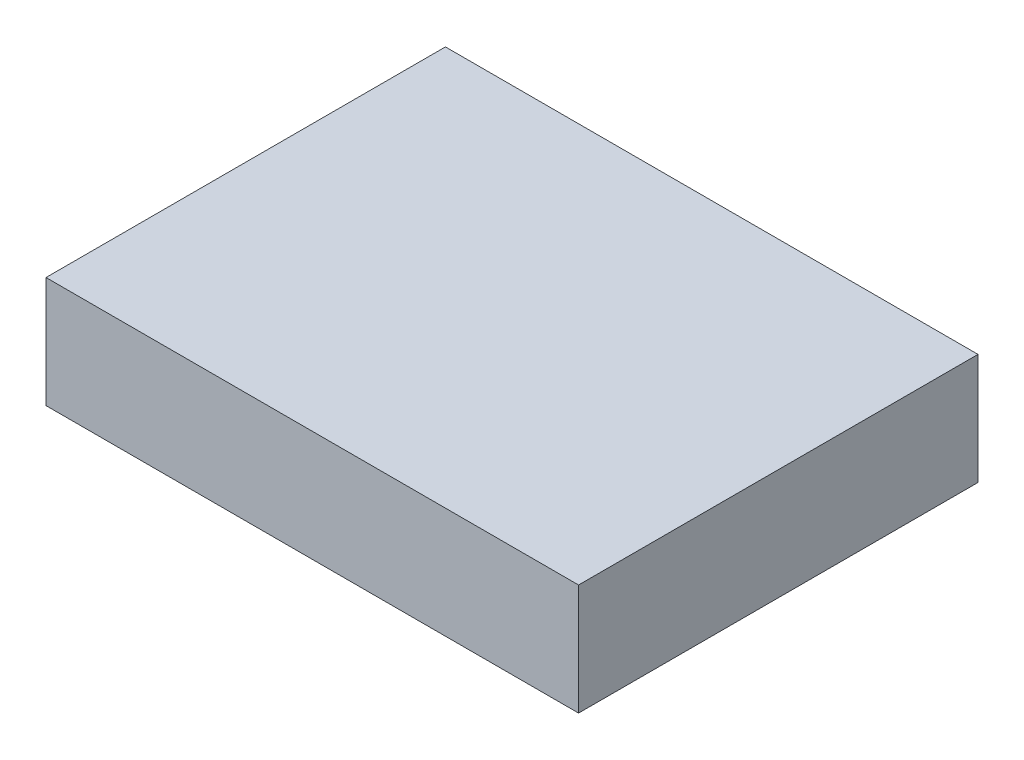
ISO-10303-21;
HEADER;
FILE_DESCRIPTION(('STEP AP214'),'2;1');
FILE_NAME('part.step','',(''),(''),'','','');
FILE_SCHEMA(('AUTOMOTIVE_DESIGN { 1 0 10303 214 1 1 1 1 }'));
ENDSEC;
DATA;
#1=APPLICATION_CONTEXT('core data for automotive mechanical design processes');
#2=APPLICATION_PROTOCOL_DEFINITION('international standard','automotive_design',2000,#1);
#3=PRODUCT_CONTEXT('',#1,'mechanical');
#4=PRODUCT('Part','Part','',(#3));
#5=PRODUCT_RELATED_PRODUCT_CATEGORY('part','',(#4));
#6=PRODUCT_DEFINITION_FORMATION('','',#4);
#7=PRODUCT_DEFINITION_CONTEXT('part definition',#1,'design');
#8=PRODUCT_DEFINITION('design','',#6,#7);
#9=PRODUCT_DEFINITION_SHAPE('','',#8);
#10=(LENGTH_UNIT() NAMED_UNIT(*) SI_UNIT(.MILLI.,.METRE.));
#11=(NAMED_UNIT(*) PLANE_ANGLE_UNIT() SI_UNIT($,.RADIAN.));
#12=(NAMED_UNIT(*) SI_UNIT($,.STERADIAN.) SOLID_ANGLE_UNIT());
#13=UNCERTAINTY_MEASURE_WITH_UNIT(LENGTH_MEASURE(1.E-05),#10,'distance_accuracy_value','');
#14=(GEOMETRIC_REPRESENTATION_CONTEXT(3) GLOBAL_UNCERTAINTY_ASSIGNED_CONTEXT((#13)) GLOBAL_UNIT_ASSIGNED_CONTEXT((#10,
#11,#12)) REPRESENTATION_CONTEXT('',''));
#15=CARTESIAN_POINT('',(0.,0.,0.));
#16=DIRECTION('',(0.,0.,1.));
#17=DIRECTION('',(1.,0.,0.));
#18=AXIS2_PLACEMENT_3D('',#15,#16,#17);
#19=CARTESIAN_POINT('',(12.,5.,9.));
#20=DIRECTION('',(-1.,0.,0.));
#21=DIRECTION('',(0.,0.,1.));
#22=AXIS2_PLACEMENT_3D('',#19,#20,#21);
#23=PLANE('',#22);
#24=DIRECTION('',(0.,0.,-1.));
#25=VECTOR('',#24,1.);
#26=CARTESIAN_POINT('',(12.,0.,9.));
#27=LINE('',#26,#25);
#28=CARTESIAN_POINT('',(12.,0.,9.));
#29=VERTEX_POINT('',#28);
#30=CARTESIAN_POINT('',(12.,0.,-9.));
#31=VERTEX_POINT('',#30);
#32=EDGE_CURVE('E107',#29,#31,#27,.T.);
#33=ORIENTED_EDGE('',*,*,#32,.T.);
#34=DIRECTION('',(0.,-1.,0.));
#35=VECTOR('',#34,1.);
#36=CARTESIAN_POINT('',(12.,5.,-9.));
#37=LINE('',#36,#35);
#38=CARTESIAN_POINT('',(12.,5.,-9.));
#39=VERTEX_POINT('',#38);
#40=EDGE_CURVE('E11',#39,#31,#37,.T.);
#41=ORIENTED_EDGE('',*,*,#40,.F.);
#42=DIRECTION('',(0.,0.,-1.));
#43=VECTOR('',#42,1.);
#44=CARTESIAN_POINT('',(12.,5.,9.));
#45=LINE('',#44,#43);
#46=CARTESIAN_POINT('',(12.,5.,9.));
#47=VERTEX_POINT('',#46);
#48=EDGE_CURVE('E91',#47,#39,#45,.T.);
#49=ORIENTED_EDGE('',*,*,#48,.F.);
#50=DIRECTION('',(0.,-1.,0.));
#51=VECTOR('',#50,1.);
#52=CARTESIAN_POINT('',(12.,5.,9.));
#53=LINE('',#52,#51);
#54=EDGE_CURVE('E103',#47,#29,#53,.T.);
#55=ORIENTED_EDGE('',*,*,#54,.T.);
#56=EDGE_LOOP('',(#33,#41,#49,#55));
#57=FACE_BOUND('',#56,.T.);
#58=ADVANCED_FACE('F39',(#57),#23,.F.);
#59=CARTESIAN_POINT('',(-12.,5.,-8.99999999999999));
#60=DIRECTION('',(0.,0.,1.));
#61=DIRECTION('',(1.,0.,0.));
#62=AXIS2_PLACEMENT_3D('',#59,#60,#61);
#63=PLANE('',#62);
#64=DIRECTION('',(-1.,0.,0.));
#65=VECTOR('',#64,1.);
#66=CARTESIAN_POINT('',(-12.,0.,-8.99999999999999));
#67=LINE('',#66,#65);
#68=CARTESIAN_POINT('',(-12.,0.,-8.99999999999999));
#69=VERTEX_POINT('',#68);
#70=EDGE_CURVE('E96',#31,#69,#67,.T.);
#71=ORIENTED_EDGE('',*,*,#70,.T.);
#72=DIRECTION('',(0.,-1.,0.));
#73=VECTOR('',#72,1.);
#74=CARTESIAN_POINT('',(-12.,5.,-8.99999999999999));
#75=LINE('',#74,#73);
#76=CARTESIAN_POINT('',(-12.,5.,-8.99999999999999));
#77=VERTEX_POINT('',#76);
#78=EDGE_CURVE('E48',#77,#69,#75,.T.);
#79=ORIENTED_EDGE('',*,*,#78,.F.);
#80=DIRECTION('',(-1.,0.,0.));
#81=VECTOR('',#80,1.);
#82=CARTESIAN_POINT('',(-12.,5.,-8.99999999999999));
#83=LINE('',#82,#81);
#84=EDGE_CURVE('E86',#39,#77,#83,.T.);
#85=ORIENTED_EDGE('',*,*,#84,.F.);
#86=ORIENTED_EDGE('',*,*,#40,.T.);
#87=EDGE_LOOP('',(#71,#79,#85,#86));
#88=FACE_BOUND('',#87,.T.);
#89=ADVANCED_FACE('F95',(#88),#63,.F.);
#90=CARTESIAN_POINT('',(-12.,5.,9.));
#91=DIRECTION('',(1.,0.,0.));
#92=DIRECTION('',(0.,0.,-1.));
#93=AXIS2_PLACEMENT_3D('',#90,#91,#92);
#94=PLANE('',#93);
#95=DIRECTION('',(0.,0.,1.));
#96=VECTOR('',#95,1.);
#97=CARTESIAN_POINT('',(-12.,0.,9.));
#98=LINE('',#97,#96);
#99=CARTESIAN_POINT('',(-12.,0.,9.));
#100=VERTEX_POINT('',#99);
#101=EDGE_CURVE('E73',#69,#100,#98,.T.);
#102=ORIENTED_EDGE('',*,*,#101,.T.);
#103=DIRECTION('',(0.,-1.,0.));
#104=VECTOR('',#103,1.);
#105=CARTESIAN_POINT('',(-12.,5.,9.));
#106=LINE('',#105,#104);
#107=CARTESIAN_POINT('',(-12.,5.,9.));
#108=VERTEX_POINT('',#107);
#109=EDGE_CURVE('E98',#108,#100,#106,.T.);
#110=ORIENTED_EDGE('',*,*,#109,.F.);
#111=DIRECTION('',(0.,0.,1.));
#112=VECTOR('',#111,1.);
#113=CARTESIAN_POINT('',(-12.,5.,9.));
#114=LINE('',#113,#112);
#115=EDGE_CURVE('E89',#77,#108,#114,.T.);
#116=ORIENTED_EDGE('',*,*,#115,.F.);
#117=ORIENTED_EDGE('',*,*,#78,.T.);
#118=EDGE_LOOP('',(#102,#110,#116,#117));
#119=FACE_BOUND('',#118,.T.);
#120=ADVANCED_FACE('F99',(#119),#94,.F.);
#121=CARTESIAN_POINT('',(-12.,5.,9.));
#122=DIRECTION('',(0.,0.,-1.));
#123=DIRECTION('',(-1.,0.,0.));
#124=AXIS2_PLACEMENT_3D('',#121,#122,#123);
#125=PLANE('',#124);
#126=DIRECTION('',(1.,0.,0.));
#127=VECTOR('',#126,1.);
#128=CARTESIAN_POINT('',(-12.,0.,9.));
#129=LINE('',#128,#127);
#130=EDGE_CURVE('E79',#100,#29,#129,.T.);
#131=ORIENTED_EDGE('',*,*,#130,.T.);
#132=ORIENTED_EDGE('',*,*,#54,.F.);
#133=DIRECTION('',(1.,0.,0.));
#134=VECTOR('',#133,1.);
#135=CARTESIAN_POINT('',(-12.,5.,9.));
#136=LINE('',#135,#134);
#137=EDGE_CURVE('E56',#108,#47,#136,.T.);
#138=ORIENTED_EDGE('',*,*,#137,.F.);
#139=ORIENTED_EDGE('',*,*,#109,.T.);
#140=EDGE_LOOP('',(#131,#132,#138,#139));
#141=FACE_BOUND('',#140,.T.);
#142=ADVANCED_FACE('F120',(#141),#125,.F.);
#143=CARTESIAN_POINT('',(0.,5.,0.));
#144=DIRECTION('',(0.,-1.,0.));
#145=DIRECTION('',(0.,0.,-1.));
#146=AXIS2_PLACEMENT_3D('',#143,#144,#145);
#147=PLANE('',#146);
#148=ORIENTED_EDGE('',*,*,#48,.T.);
#149=ORIENTED_EDGE('',*,*,#84,.T.);
#150=ORIENTED_EDGE('',*,*,#115,.T.);
#151=ORIENTED_EDGE('',*,*,#137,.T.);
#152=EDGE_LOOP('',(#148,#149,#150,#151));
#153=FACE_BOUND('',#152,.T.);
#154=ADVANCED_FACE('F87',(#153),#147,.F.);
#155=CARTESIAN_POINT('',(0.,0.,0.));
#156=DIRECTION('',(0.,-1.,0.));
#157=DIRECTION('',(0.,0.,-1.));
#158=AXIS2_PLACEMENT_3D('',#155,#156,#157);
#159=PLANE('',#158);
#160=ORIENTED_EDGE('',*,*,#32,.F.);
#161=ORIENTED_EDGE('',*,*,#130,.F.);
#162=ORIENTED_EDGE('',*,*,#101,.F.);
#163=ORIENTED_EDGE('',*,*,#70,.F.);
#164=EDGE_LOOP('',(#160,#161,#162,#163));
#165=FACE_BOUND('',#164,.T.);
#166=ADVANCED_FACE('F123',(#165),#159,.T.);
#167=CLOSED_SHELL('',(#58,#89,#120,#142,#154,#166));
#168=MANIFOLD_SOLID_BREP('B2',#167);
#169=ADVANCED_BREP_SHAPE_REPRESENTATION('',(#18,#168),#14);
#170=SHAPE_DEFINITION_REPRESENTATION(#9,#169);
ENDSEC;
END-ISO-10303-21;
